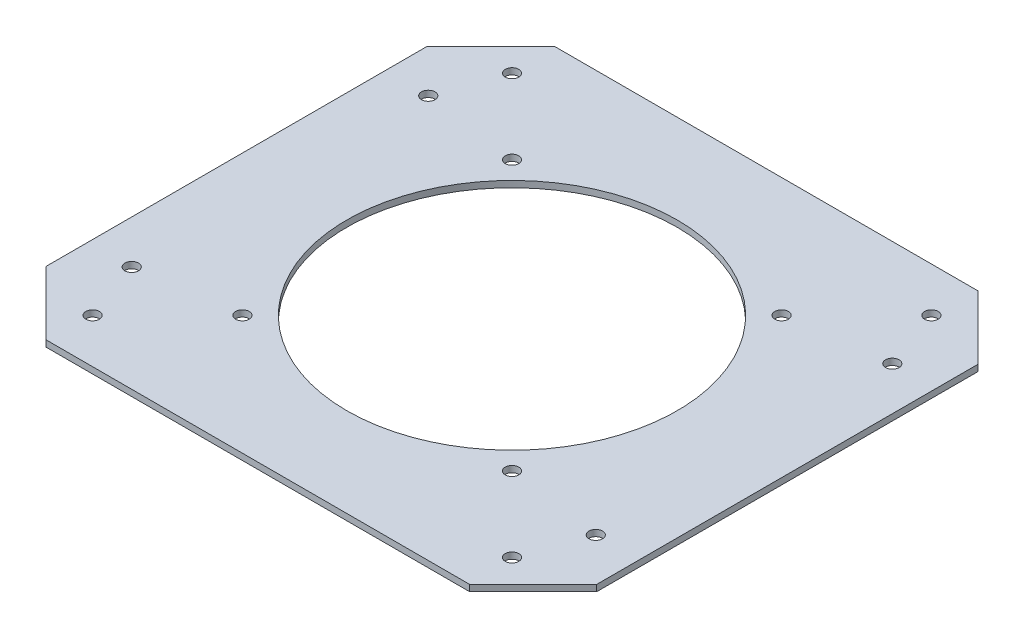
ISO-10303-21;
HEADER;
FILE_DESCRIPTION(('STEP AP214'),'2;1');
FILE_NAME('part.step','',(''),(''),'','','');
FILE_SCHEMA(('AUTOMOTIVE_DESIGN { 1 0 10303 214 1 1 1 1 }'));
ENDSEC;
DATA;
#1=APPLICATION_CONTEXT('core data for automotive mechanical design processes');
#2=APPLICATION_PROTOCOL_DEFINITION('international standard','automotive_design',2000,#1);
#3=PRODUCT_CONTEXT('',#1,'mechanical');
#4=PRODUCT('Part','Part','',(#3));
#5=PRODUCT_RELATED_PRODUCT_CATEGORY('part','',(#4));
#6=PRODUCT_DEFINITION_FORMATION('','',#4);
#7=PRODUCT_DEFINITION_CONTEXT('part definition',#1,'design');
#8=PRODUCT_DEFINITION('design','',#6,#7);
#9=PRODUCT_DEFINITION_SHAPE('','',#8);
#10=(LENGTH_UNIT() NAMED_UNIT(*) SI_UNIT(.MILLI.,.METRE.));
#11=(NAMED_UNIT(*) PLANE_ANGLE_UNIT() SI_UNIT($,.RADIAN.));
#12=(NAMED_UNIT(*) SI_UNIT($,.STERADIAN.) SOLID_ANGLE_UNIT());
#13=UNCERTAINTY_MEASURE_WITH_UNIT(LENGTH_MEASURE(1.E-05),#10,'distance_accuracy_value','');
#14=(GEOMETRIC_REPRESENTATION_CONTEXT(3) GLOBAL_UNCERTAINTY_ASSIGNED_CONTEXT((#13)) GLOBAL_UNIT_ASSIGNED_CONTEXT((#10,
#11,#12)) REPRESENTATION_CONTEXT('',''));
#15=CARTESIAN_POINT('',(0.,0.,0.));
#16=DIRECTION('',(0.,0.,1.));
#17=DIRECTION('',(1.,0.,0.));
#18=AXIS2_PLACEMENT_3D('',#15,#16,#17);
#19=CARTESIAN_POINT('',(-54.7722563,-43.7945736406198,-35.));
#20=DIRECTION('',(0.,1.,0.));
#21=DIRECTION('',(0.,0.,1.));
#22=AXIS2_PLACEMENT_3D('',#19,#20,#21);
#23=CYLINDRICAL_SURFACE('',#22,1.6);
#24=CARTESIAN_POINT('',(-54.7722563,5.5,-35.));
#25=DIRECTION('',(0.,1.,0.));
#26=DIRECTION('',(0.,0.,1.));
#27=AXIS2_PLACEMENT_3D('',#24,#25,#26);
#28=CIRCLE('',#27,1.6);
#29=CARTESIAN_POINT('',(-54.7722563,5.5,-33.4));
#30=VERTEX_POINT('',#29);
#31=EDGE_CURVE('E228',#30,#30,#28,.T.);
#32=ORIENTED_EDGE('',*,*,#31,.T.);
#33=EDGE_LOOP('',(#32));
#34=FACE_BOUND('',#33,.T.);
#35=CARTESIAN_POINT('',(-54.7722563,4.,-35.));
#36=DIRECTION('',(0.,-1.,0.));
#37=DIRECTION('',(0.,0.,-1.));
#38=AXIS2_PLACEMENT_3D('',#35,#36,#37);
#39=CIRCLE('',#38,1.6);
#40=CARTESIAN_POINT('',(-54.7722563,4.,-36.6));
#41=VERTEX_POINT('',#40);
#42=EDGE_CURVE('E225',#41,#41,#39,.F.);
#43=ORIENTED_EDGE('',*,*,#42,.F.);
#44=EDGE_LOOP('',(#43));
#45=FACE_BOUND('',#44,.T.);
#46=ADVANCED_FACE('F70',(#34,#45),#23,.F.);
#47=CARTESIAN_POINT('',(54.7722563,-43.7945736406198,-35.));
#48=DIRECTION('',(0.,1.,0.));
#49=DIRECTION('',(0.,0.,1.));
#50=AXIS2_PLACEMENT_3D('',#47,#48,#49);
#51=CYLINDRICAL_SURFACE('',#50,1.6);
#52=CARTESIAN_POINT('',(54.7722563,5.5,-35.));
#53=DIRECTION('',(0.,1.,0.));
#54=DIRECTION('',(0.,0.,1.));
#55=AXIS2_PLACEMENT_3D('',#52,#53,#54);
#56=CIRCLE('',#55,1.59999999999999);
#57=CARTESIAN_POINT('',(54.7722563,5.5,-33.4));
#58=VERTEX_POINT('',#57);
#59=EDGE_CURVE('E237',#58,#58,#56,.T.);
#60=ORIENTED_EDGE('',*,*,#59,.T.);
#61=EDGE_LOOP('',(#60));
#62=FACE_BOUND('',#61,.T.);
#63=CARTESIAN_POINT('',(54.7722563,4.,-35.));
#64=DIRECTION('',(0.,-1.,0.));
#65=DIRECTION('',(0.,0.,-1.));
#66=AXIS2_PLACEMENT_3D('',#63,#64,#65);
#67=CIRCLE('',#66,1.6);
#68=CARTESIAN_POINT('',(54.7722563,4.,-36.6));
#69=VERTEX_POINT('',#68);
#70=EDGE_CURVE('E222',#69,#69,#67,.F.);
#71=ORIENTED_EDGE('',*,*,#70,.F.);
#72=EDGE_LOOP('',(#71));
#73=FACE_BOUND('',#72,.T.);
#74=ADVANCED_FACE('F327',(#62,#73),#51,.F.);
#75=CARTESIAN_POINT('',(54.7722563,-43.7945736406198,35.));
#76=DIRECTION('',(0.,1.,0.));
#77=DIRECTION('',(0.,0.,1.));
#78=AXIS2_PLACEMENT_3D('',#75,#76,#77);
#79=CYLINDRICAL_SURFACE('',#78,1.6);
#80=CARTESIAN_POINT('',(54.7722563,5.5,35.));
#81=DIRECTION('',(0.,1.,0.));
#82=DIRECTION('',(0.,0.,1.));
#83=AXIS2_PLACEMENT_3D('',#80,#81,#82);
#84=CIRCLE('',#83,1.6);
#85=CARTESIAN_POINT('',(54.7722563,5.5,36.6));
#86=VERTEX_POINT('',#85);
#87=EDGE_CURVE('E234',#86,#86,#84,.T.);
#88=ORIENTED_EDGE('',*,*,#87,.T.);
#89=EDGE_LOOP('',(#88));
#90=FACE_BOUND('',#89,.T.);
#91=CARTESIAN_POINT('',(54.7722563,4.,35.));
#92=DIRECTION('',(0.,-1.,0.));
#93=DIRECTION('',(0.,0.,-1.));
#94=AXIS2_PLACEMENT_3D('',#91,#92,#93);
#95=CIRCLE('',#94,1.6);
#96=CARTESIAN_POINT('',(54.7722563,4.,33.4));
#97=VERTEX_POINT('',#96);
#98=EDGE_CURVE('E219',#97,#97,#95,.F.);
#99=ORIENTED_EDGE('',*,*,#98,.F.);
#100=EDGE_LOOP('',(#99));
#101=FACE_BOUND('',#100,.T.);
#102=ADVANCED_FACE('F332',(#90,#101),#79,.F.);
#103=CARTESIAN_POINT('',(-54.7722563,-43.7945736406198,35.));
#104=DIRECTION('',(0.,1.,0.));
#105=DIRECTION('',(0.,0.,1.));
#106=AXIS2_PLACEMENT_3D('',#103,#104,#105);
#107=CYLINDRICAL_SURFACE('',#106,1.6);
#108=CARTESIAN_POINT('',(-54.7722563,5.5,35.));
#109=DIRECTION('',(0.,1.,0.));
#110=DIRECTION('',(0.,0.,1.));
#111=AXIS2_PLACEMENT_3D('',#108,#109,#110);
#112=CIRCLE('',#111,1.6);
#113=CARTESIAN_POINT('',(-54.7722563,5.5,36.6));
#114=VERTEX_POINT('',#113);
#115=EDGE_CURVE('E231',#114,#114,#112,.T.);
#116=ORIENTED_EDGE('',*,*,#115,.T.);
#117=EDGE_LOOP('',(#116));
#118=FACE_BOUND('',#117,.T.);
#119=CARTESIAN_POINT('',(-54.7722563,4.,35.));
#120=DIRECTION('',(0.,-1.,0.));
#121=DIRECTION('',(0.,0.,-1.));
#122=AXIS2_PLACEMENT_3D('',#119,#120,#121);
#123=CIRCLE('',#122,1.6);
#124=CARTESIAN_POINT('',(-54.7722563,4.,33.4));
#125=VERTEX_POINT('',#124);
#126=EDGE_CURVE('E216',#125,#125,#123,.F.);
#127=ORIENTED_EDGE('',*,*,#126,.F.);
#128=EDGE_LOOP('',(#127));
#129=FACE_BOUND('',#128,.T.);
#130=ADVANCED_FACE('F340',(#118,#129),#107,.F.);
#131=CARTESIAN_POINT('',(0.,5.5,0.));
#132=DIRECTION('',(0.,-1.,0.));
#133=DIRECTION('',(0.,0.,-1.));
#134=AXIS2_PLACEMENT_3D('',#131,#132,#133);
#135=PLANE('',#134);
#136=CARTESIAN_POINT('',(49.4974746830588,5.5,-49.4974746830578));
#137=DIRECTION('',(0.,1.,0.));
#138=DIRECTION('',(0.,0.,1.));
#139=AXIS2_PLACEMENT_3D('',#136,#137,#138);
#140=CIRCLE('',#139,1.6);
#141=CARTESIAN_POINT('',(49.4974746830588,5.5,-47.8974746830578));
#142=VERTEX_POINT('',#141);
#143=EDGE_CURVE('E301',#142,#142,#140,.T.);
#144=ORIENTED_EDGE('',*,*,#143,.F.);
#145=EDGE_LOOP('',(#144));
#146=FACE_BOUND('',#145,.T.);
#147=CARTESIAN_POINT('',(-49.497474683058,5.5,-49.4974746830587));
#148=DIRECTION('',(0.,1.,0.));
#149=DIRECTION('',(0.,0.,1.));
#150=AXIS2_PLACEMENT_3D('',#147,#148,#149);
#151=CIRCLE('',#150,1.6);
#152=CARTESIAN_POINT('',(-49.497474683058,5.5,-47.8974746830587));
#153=VERTEX_POINT('',#152);
#154=EDGE_CURVE('E298',#153,#153,#151,.T.);
#155=ORIENTED_EDGE('',*,*,#154,.F.);
#156=EDGE_LOOP('',(#155));
#157=FACE_BOUND('',#156,.T.);
#158=CARTESIAN_POINT('',(-49.4974746830585,5.5,49.4974746830582));
#159=DIRECTION('',(0.,1.,0.));
#160=DIRECTION('',(0.,0.,1.));
#161=AXIS2_PLACEMENT_3D('',#158,#159,#160);
#162=CIRCLE('',#161,1.6);
#163=CARTESIAN_POINT('',(-49.4974746830585,5.5,51.0974746830581));
#164=VERTEX_POINT('',#163);
#165=EDGE_CURVE('E295',#164,#164,#162,.T.);
#166=ORIENTED_EDGE('',*,*,#165,.F.);
#167=EDGE_LOOP('',(#166));
#168=FACE_BOUND('',#167,.T.);
#169=CARTESIAN_POINT('',(49.4974746830583,5.5,49.4974746830583));
#170=DIRECTION('',(0.,1.,0.));
#171=DIRECTION('',(0.,0.,1.));
#172=AXIS2_PLACEMENT_3D('',#169,#170,#171);
#173=CIRCLE('',#172,1.6);
#174=CARTESIAN_POINT('',(49.4974746830583,5.5,51.0974746830583));
#175=VERTEX_POINT('',#174);
#176=EDGE_CURVE('E264',#175,#175,#173,.T.);
#177=ORIENTED_EDGE('',*,*,#176,.F.);
#178=EDGE_LOOP('',(#177));
#179=FACE_BOUND('',#178,.T.);
#180=DIRECTION('',(-1.,0.,0.));
#181=VECTOR('',#180,1.);
#182=CARTESIAN_POINT('',(50.,5.5,-60.));
#183=LINE('',#182,#181);
#184=CARTESIAN_POINT('',(50.,5.5,-60.));
#185=VERTEX_POINT('',#184);
#186=CARTESIAN_POINT('',(-50.,5.5,-60.));
#187=VERTEX_POINT('',#186);
#188=EDGE_CURVE('E188',#185,#187,#183,.T.);
#189=ORIENTED_EDGE('',*,*,#188,.T.);
#190=DIRECTION('',(-0.707106781186548,0.,0.707106781186548));
#191=VECTOR('',#190,1.);
#192=CARTESIAN_POINT('',(-65.,5.5,-45.));
#193=LINE('',#192,#191);
#194=CARTESIAN_POINT('',(-65.,5.5,-45.));
#195=VERTEX_POINT('',#194);
#196=EDGE_CURVE('E129',#187,#195,#193,.T.);
#197=ORIENTED_EDGE('',*,*,#196,.T.);
#198=DIRECTION('',(0.,0.,1.));
#199=VECTOR('',#198,1.);
#200=CARTESIAN_POINT('',(-65.,5.5,0.));
#201=LINE('',#200,#199);
#202=CARTESIAN_POINT('',(-65.,5.5,45.));
#203=VERTEX_POINT('',#202);
#204=EDGE_CURVE('E88',#195,#203,#201,.T.);
#205=ORIENTED_EDGE('',*,*,#204,.T.);
#206=DIRECTION('',(0.707106781186548,0.,0.707106781186548));
#207=VECTOR('',#206,1.);
#208=CARTESIAN_POINT('',(-65.,5.5,45.));
#209=LINE('',#208,#207);
#210=CARTESIAN_POINT('',(-49.9999999999999,5.5,60.));
#211=VERTEX_POINT('',#210);
#212=EDGE_CURVE('E242',#203,#211,#209,.T.);
#213=ORIENTED_EDGE('',*,*,#212,.T.);
#214=DIRECTION('',(1.,0.,0.));
#215=VECTOR('',#214,1.);
#216=CARTESIAN_POINT('',(50.,5.5,60.));
#217=LINE('',#216,#215);
#218=CARTESIAN_POINT('',(50.,5.5,60.));
#219=VERTEX_POINT('',#218);
#220=EDGE_CURVE('E179',#211,#219,#217,.T.);
#221=ORIENTED_EDGE('',*,*,#220,.T.);
#222=DIRECTION('',(0.707106781186549,0.,-0.707106781186546));
#223=VECTOR('',#222,1.);
#224=CARTESIAN_POINT('',(65.,5.5,45.));
#225=LINE('',#224,#223);
#226=CARTESIAN_POINT('',(65.,5.5,45.));
#227=VERTEX_POINT('',#226);
#228=EDGE_CURVE('E182',#219,#227,#225,.T.);
#229=ORIENTED_EDGE('',*,*,#228,.T.);
#230=DIRECTION('',(0.,0.,-1.));
#231=VECTOR('',#230,1.);
#232=CARTESIAN_POINT('',(65.,5.5,45.));
#233=LINE('',#232,#231);
#234=CARTESIAN_POINT('',(65.,5.5,-45.));
#235=VERTEX_POINT('',#234);
#236=EDGE_CURVE('E185',#227,#235,#233,.T.);
#237=ORIENTED_EDGE('',*,*,#236,.T.);
#238=DIRECTION('',(-0.707106781186549,0.,-0.707106781186546));
#239=VECTOR('',#238,1.);
#240=CARTESIAN_POINT('',(65.,5.5,-45.));
#241=LINE('',#240,#239);
#242=EDGE_CURVE('E153',#235,#185,#241,.T.);
#243=ORIENTED_EDGE('',*,*,#242,.T.);
#244=EDGE_LOOP('',(#189,#197,#205,#213,#221,#229,#237,#243));
#245=FACE_BOUND('',#244,.T.);
#246=CARTESIAN_POINT('',(-31.819805153395,5.5,-31.8198051533947));
#247=DIRECTION('',(0.,1.,0.));
#248=DIRECTION('',(0.,0.,1.));
#249=AXIS2_PLACEMENT_3D('',#246,#247,#248);
#250=CIRCLE('',#249,1.6);
#251=CARTESIAN_POINT('',(-31.819805153395,5.5,-30.2198051533947));
#252=VERTEX_POINT('',#251);
#253=EDGE_CURVE('E202',#252,#252,#250,.T.);
#254=ORIENTED_EDGE('',*,*,#253,.F.);
#255=EDGE_LOOP('',(#254));
#256=FACE_BOUND('',#255,.T.);
#257=CARTESIAN_POINT('',(31.8198051533946,5.5,31.8198051533942));
#258=DIRECTION('',(0.,1.,0.));
#259=DIRECTION('',(0.,0.,1.));
#260=AXIS2_PLACEMENT_3D('',#257,#258,#259);
#261=CIRCLE('',#260,1.6);
#262=CARTESIAN_POINT('',(31.8198051533946,5.5,33.4198051533942));
#263=VERTEX_POINT('',#262);
#264=EDGE_CURVE('E201',#263,#263,#261,.T.);
#265=ORIENTED_EDGE('',*,*,#264,.F.);
#266=EDGE_LOOP('',(#265));
#267=FACE_BOUND('',#266,.T.);
#268=CARTESIAN_POINT('',(-31.819805153395,5.5,31.8198051533956));
#269=DIRECTION('',(0.,1.,0.));
#270=DIRECTION('',(0.,0.,1.));
#271=AXIS2_PLACEMENT_3D('',#268,#269,#270);
#272=CIRCLE('',#271,1.6);
#273=CARTESIAN_POINT('',(-31.819805153395,5.5,33.4198051533956));
#274=VERTEX_POINT('',#273);
#275=EDGE_CURVE('E193',#274,#274,#272,.T.);
#276=ORIENTED_EDGE('',*,*,#275,.F.);
#277=EDGE_LOOP('',(#276));
#278=FACE_BOUND('',#277,.T.);
#279=CARTESIAN_POINT('',(31.8198051533946,5.5,-31.8198051533947));
#280=DIRECTION('',(0.,1.,0.));
#281=DIRECTION('',(0.,0.,1.));
#282=AXIS2_PLACEMENT_3D('',#279,#280,#281);
#283=CIRCLE('',#282,1.6);
#284=CARTESIAN_POINT('',(31.8198051533946,5.5,-30.2198051533947));
#285=VERTEX_POINT('',#284);
#286=EDGE_CURVE('E205',#285,#285,#283,.T.);
#287=ORIENTED_EDGE('',*,*,#286,.F.);
#288=EDGE_LOOP('',(#287));
#289=FACE_BOUND('',#288,.T.);
#290=CARTESIAN_POINT('',(0.,5.5,0.));
#291=DIRECTION('',(0.,1.,0.));
#292=DIRECTION('',(0.,0.,1.));
#293=AXIS2_PLACEMENT_3D('',#290,#291,#292);
#294=CIRCLE('',#293,39.);
#295=CARTESIAN_POINT('',(0.,5.5,39.));
#296=VERTEX_POINT('',#295);
#297=EDGE_CURVE('E211',#296,#296,#294,.T.);
#298=ORIENTED_EDGE('',*,*,#297,.F.);
#299=EDGE_LOOP('',(#298));
#300=FACE_BOUND('',#299,.T.);
#301=ORIENTED_EDGE('',*,*,#59,.F.);
#302=EDGE_LOOP('',(#301));
#303=FACE_BOUND('',#302,.T.);
#304=ORIENTED_EDGE('',*,*,#87,.F.);
#305=EDGE_LOOP('',(#304));
#306=FACE_BOUND('',#305,.T.);
#307=ORIENTED_EDGE('',*,*,#115,.F.);
#308=EDGE_LOOP('',(#307));
#309=FACE_BOUND('',#308,.T.);
#310=ORIENTED_EDGE('',*,*,#31,.F.);
#311=EDGE_LOOP('',(#310));
#312=FACE_BOUND('',#311,.T.);
#313=ADVANCED_FACE('F279',(#146,#157,#168,#179,#245,#256,#267,#278,#289,#300,#303,#306,#309,
#312),#135,.F.);
#314=CARTESIAN_POINT('',(0.,4.,0.));
#315=DIRECTION('',(0.,-1.,0.));
#316=DIRECTION('',(0.,0.,-1.));
#317=AXIS2_PLACEMENT_3D('',#314,#315,#316);
#318=PLANE('',#317);
#319=CARTESIAN_POINT('',(49.4974746830588,4.,-49.4974746830578));
#320=DIRECTION('',(0.,-1.,0.));
#321=DIRECTION('',(0.,0.,-1.));
#322=AXIS2_PLACEMENT_3D('',#319,#320,#321);
#323=CIRCLE('',#322,1.6);
#324=CARTESIAN_POINT('',(49.4974746830588,4.,-51.0974746830578));
#325=VERTEX_POINT('',#324);
#326=EDGE_CURVE('E73',#325,#325,#323,.T.);
#327=ORIENTED_EDGE('',*,*,#326,.F.);
#328=EDGE_LOOP('',(#327));
#329=FACE_BOUND('',#328,.T.);
#330=CARTESIAN_POINT('',(-49.497474683058,4.,-49.4974746830587));
#331=DIRECTION('',(0.,-1.,0.));
#332=DIRECTION('',(0.,0.,-1.));
#333=AXIS2_PLACEMENT_3D('',#330,#331,#332);
#334=CIRCLE('',#333,1.6);
#335=CARTESIAN_POINT('',(-49.497474683058,4.,-51.0974746830587));
#336=VERTEX_POINT('',#335);
#337=EDGE_CURVE('E266',#336,#336,#334,.T.);
#338=ORIENTED_EDGE('',*,*,#337,.F.);
#339=EDGE_LOOP('',(#338));
#340=FACE_BOUND('',#339,.T.);
#341=CARTESIAN_POINT('',(-49.4974746830585,4.,49.4974746830582));
#342=DIRECTION('',(0.,-1.,0.));
#343=DIRECTION('',(0.,0.,-1.));
#344=AXIS2_PLACEMENT_3D('',#341,#342,#343);
#345=CIRCLE('',#344,1.6);
#346=CARTESIAN_POINT('',(-49.4974746830585,4.,47.8974746830582));
#347=VERTEX_POINT('',#346);
#348=EDGE_CURVE('E263',#347,#347,#345,.T.);
#349=ORIENTED_EDGE('',*,*,#348,.F.);
#350=EDGE_LOOP('',(#349));
#351=FACE_BOUND('',#350,.T.);
#352=CARTESIAN_POINT('',(49.4974746830583,4.,49.4974746830583));
#353=DIRECTION('',(0.,-1.,0.));
#354=DIRECTION('',(0.,0.,-1.));
#355=AXIS2_PLACEMENT_3D('',#352,#353,#354);
#356=CIRCLE('',#355,1.6);
#357=CARTESIAN_POINT('',(49.4974746830583,4.,47.8974746830583));
#358=VERTEX_POINT('',#357);
#359=EDGE_CURVE('E260',#358,#358,#356,.T.);
#360=ORIENTED_EDGE('',*,*,#359,.F.);
#361=EDGE_LOOP('',(#360));
#362=FACE_BOUND('',#361,.T.);
#363=DIRECTION('',(-0.707106781186548,0.,0.707106781186548));
#364=VECTOR('',#363,1.);
#365=CARTESIAN_POINT('',(-65.,4.,-45.));
#366=LINE('',#365,#364);
#367=CARTESIAN_POINT('',(-50.,4.,-60.));
#368=VERTEX_POINT('',#367);
#369=CARTESIAN_POINT('',(-65.,4.,-45.));
#370=VERTEX_POINT('',#369);
#371=EDGE_CURVE('E104',#368,#370,#366,.T.);
#372=ORIENTED_EDGE('',*,*,#371,.F.);
#373=DIRECTION('',(-1.,0.,0.));
#374=VECTOR('',#373,1.);
#375=CARTESIAN_POINT('',(50.,4.,-60.));
#376=LINE('',#375,#374);
#377=CARTESIAN_POINT('',(50.,4.,-60.));
#378=VERTEX_POINT('',#377);
#379=EDGE_CURVE('E168',#378,#368,#376,.T.);
#380=ORIENTED_EDGE('',*,*,#379,.F.);
#381=DIRECTION('',(-0.707106781186549,0.,-0.707106781186546));
#382=VECTOR('',#381,1.);
#383=CARTESIAN_POINT('',(65.,4.,-45.));
#384=LINE('',#383,#382);
#385=CARTESIAN_POINT('',(65.,4.,-45.));
#386=VERTEX_POINT('',#385);
#387=EDGE_CURVE('E151',#386,#378,#384,.T.);
#388=ORIENTED_EDGE('',*,*,#387,.F.);
#389=DIRECTION('',(0.,0.,-1.));
#390=VECTOR('',#389,1.);
#391=CARTESIAN_POINT('',(65.,4.,45.));
#392=LINE('',#391,#390);
#393=CARTESIAN_POINT('',(65.,4.,45.));
#394=VERTEX_POINT('',#393);
#395=EDGE_CURVE('E165',#394,#386,#392,.T.);
#396=ORIENTED_EDGE('',*,*,#395,.F.);
#397=DIRECTION('',(0.707106781186549,0.,-0.707106781186546));
#398=VECTOR('',#397,1.);
#399=CARTESIAN_POINT('',(65.,4.,45.));
#400=LINE('',#399,#398);
#401=CARTESIAN_POINT('',(50.,4.,60.));
#402=VERTEX_POINT('',#401);
#403=EDGE_CURVE('E171',#402,#394,#400,.T.);
#404=ORIENTED_EDGE('',*,*,#403,.F.);
#405=DIRECTION('',(1.,0.,0.));
#406=VECTOR('',#405,1.);
#407=CARTESIAN_POINT('',(50.,4.,60.));
#408=LINE('',#407,#406);
#409=CARTESIAN_POINT('',(-49.9999999999999,4.,60.));
#410=VERTEX_POINT('',#409);
#411=EDGE_CURVE('E173',#410,#402,#408,.T.);
#412=ORIENTED_EDGE('',*,*,#411,.F.);
#413=DIRECTION('',(0.707106781186548,0.,0.707106781186548));
#414=VECTOR('',#413,1.);
#415=CARTESIAN_POINT('',(-65.,4.,45.));
#416=LINE('',#415,#414);
#417=CARTESIAN_POINT('',(-65.,4.,45.));
#418=VERTEX_POINT('',#417);
#419=EDGE_CURVE('E137',#418,#410,#416,.T.);
#420=ORIENTED_EDGE('',*,*,#419,.F.);
#421=DIRECTION('',(0.,0.,1.));
#422=VECTOR('',#421,1.);
#423=CARTESIAN_POINT('',(-65.,4.,0.));
#424=LINE('',#423,#422);
#425=EDGE_CURVE('E99',#370,#418,#424,.T.);
#426=ORIENTED_EDGE('',*,*,#425,.F.);
#427=EDGE_LOOP('',(#372,#380,#388,#396,#404,#412,#420,#426));
#428=FACE_BOUND('',#427,.T.);
#429=CARTESIAN_POINT('',(-31.819805153395,4.,-31.8198051533947));
#430=DIRECTION('',(0.,-1.,0.));
#431=DIRECTION('',(0.,0.,-1.));
#432=AXIS2_PLACEMENT_3D('',#429,#430,#431);
#433=CIRCLE('',#432,1.6);
#434=CARTESIAN_POINT('',(-31.819805153395,4.,-33.4198051533947));
#435=VERTEX_POINT('',#434);
#436=EDGE_CURVE('E215',#435,#435,#433,.T.);
#437=ORIENTED_EDGE('',*,*,#436,.F.);
#438=EDGE_LOOP('',(#437));
#439=FACE_BOUND('',#438,.T.);
#440=CARTESIAN_POINT('',(31.8198051533946,4.,31.8198051533942));
#441=DIRECTION('',(0.,-1.,0.));
#442=DIRECTION('',(0.,0.,-1.));
#443=AXIS2_PLACEMENT_3D('',#440,#441,#442);
#444=CIRCLE('',#443,1.6);
#445=CARTESIAN_POINT('',(31.8198051533946,4.,30.2198051533943));
#446=VERTEX_POINT('',#445);
#447=EDGE_CURVE('E255',#446,#446,#444,.T.);
#448=ORIENTED_EDGE('',*,*,#447,.F.);
#449=EDGE_LOOP('',(#448));
#450=FACE_BOUND('',#449,.T.);
#451=CARTESIAN_POINT('',(-31.819805153395,4.,31.8198051533956));
#452=DIRECTION('',(0.,-1.,0.));
#453=DIRECTION('',(0.,0.,-1.));
#454=AXIS2_PLACEMENT_3D('',#451,#452,#453);
#455=CIRCLE('',#454,1.6);
#456=CARTESIAN_POINT('',(-31.819805153395,4.,30.2198051533956));
#457=VERTEX_POINT('',#456);
#458=EDGE_CURVE('E252',#457,#457,#455,.T.);
#459=ORIENTED_EDGE('',*,*,#458,.F.);
#460=EDGE_LOOP('',(#459));
#461=FACE_BOUND('',#460,.T.);
#462=CARTESIAN_POINT('',(31.8198051533946,4.,-31.8198051533947));
#463=DIRECTION('',(0.,-1.,0.));
#464=DIRECTION('',(0.,0.,-1.));
#465=AXIS2_PLACEMENT_3D('',#462,#463,#464);
#466=CIRCLE('',#465,1.6);
#467=CARTESIAN_POINT('',(31.8198051533946,4.,-33.4198051533947));
#468=VERTEX_POINT('',#467);
#469=EDGE_CURVE('E210',#468,#468,#466,.T.);
#470=ORIENTED_EDGE('',*,*,#469,.F.);
#471=EDGE_LOOP('',(#470));
#472=FACE_BOUND('',#471,.T.);
#473=CARTESIAN_POINT('',(0.,4.,0.));
#474=DIRECTION('',(0.,-1.,0.));
#475=DIRECTION('',(0.,0.,-1.));
#476=AXIS2_PLACEMENT_3D('',#473,#474,#475);
#477=CIRCLE('',#476,39.);
#478=CARTESIAN_POINT('',(0.,4.,-39.));
#479=VERTEX_POINT('',#478);
#480=EDGE_CURVE('E214',#479,#479,#477,.T.);
#481=ORIENTED_EDGE('',*,*,#480,.F.);
#482=EDGE_LOOP('',(#481));
#483=FACE_BOUND('',#482,.T.);
#484=ORIENTED_EDGE('',*,*,#126,.T.);
#485=EDGE_LOOP('',(#484));
#486=FACE_BOUND('',#485,.T.);
#487=ORIENTED_EDGE('',*,*,#98,.T.);
#488=EDGE_LOOP('',(#487));
#489=FACE_BOUND('',#488,.T.);
#490=ORIENTED_EDGE('',*,*,#70,.T.);
#491=EDGE_LOOP('',(#490));
#492=FACE_BOUND('',#491,.T.);
#493=ORIENTED_EDGE('',*,*,#42,.T.);
#494=EDGE_LOOP('',(#493));
#495=FACE_BOUND('',#494,.T.);
#496=ADVANCED_FACE('F162',(#329,#340,#351,#362,#428,#439,#450,#461,#472,#483,#486,#489,#492,
#495),#318,.T.);
#497=CARTESIAN_POINT('',(-65.,5.5,-45.));
#498=DIRECTION('',(0.707106781186547,0.,0.707106781186547));
#499=DIRECTION('',(0.707106781186548,0.,-0.707106781186548));
#500=AXIS2_PLACEMENT_3D('',#497,#498,#499);
#501=PLANE('',#500);
#502=ORIENTED_EDGE('',*,*,#371,.T.);
#503=DIRECTION('',(0.,-1.,0.));
#504=VECTOR('',#503,1.);
#505=CARTESIAN_POINT('',(-65.,5.5,-45.));
#506=LINE('',#505,#504);
#507=EDGE_CURVE('E12',#195,#370,#506,.T.);
#508=ORIENTED_EDGE('',*,*,#507,.F.);
#509=ORIENTED_EDGE('',*,*,#196,.F.);
#510=DIRECTION('',(0.,1.,0.));
#511=VECTOR('',#510,1.);
#512=CARTESIAN_POINT('',(-50.,4.,-60.));
#513=LINE('',#512,#511);
#514=EDGE_CURVE('E191',#368,#187,#513,.T.);
#515=ORIENTED_EDGE('',*,*,#514,.F.);
#516=EDGE_LOOP('',(#502,#508,#509,#515));
#517=FACE_BOUND('',#516,.T.);
#518=ADVANCED_FACE('F278',(#517),#501,.F.);
#519=CARTESIAN_POINT('',(-65.,5.5,0.));
#520=DIRECTION('',(1.,0.,0.));
#521=DIRECTION('',(0.,0.,-1.));
#522=AXIS2_PLACEMENT_3D('',#519,#520,#521);
#523=PLANE('',#522);
#524=ORIENTED_EDGE('',*,*,#425,.T.);
#525=DIRECTION('',(0.,-1.,0.));
#526=VECTOR('',#525,1.);
#527=CARTESIAN_POINT('',(-65.,5.5,45.));
#528=LINE('',#527,#526);
#529=EDGE_CURVE('E79',#203,#418,#528,.T.);
#530=ORIENTED_EDGE('',*,*,#529,.F.);
#531=ORIENTED_EDGE('',*,*,#204,.F.);
#532=ORIENTED_EDGE('',*,*,#507,.T.);
#533=EDGE_LOOP('',(#524,#530,#531,#532));
#534=FACE_BOUND('',#533,.T.);
#535=ADVANCED_FACE('F315',(#534),#523,.F.);
#536=CARTESIAN_POINT('',(-65.,5.5,45.));
#537=DIRECTION('',(0.707106781186547,0.,-0.707106781186547));
#538=DIRECTION('',(-0.707106781186548,0.,-0.707106781186548));
#539=AXIS2_PLACEMENT_3D('',#536,#537,#538);
#540=PLANE('',#539);
#541=ORIENTED_EDGE('',*,*,#419,.T.);
#542=DIRECTION('',(0.,1.,0.));
#543=VECTOR('',#542,1.);
#544=CARTESIAN_POINT('',(-49.9999999999999,4.,60.));
#545=LINE('',#544,#543);
#546=EDGE_CURVE('E178',#410,#211,#545,.T.);
#547=ORIENTED_EDGE('',*,*,#546,.T.);
#548=ORIENTED_EDGE('',*,*,#212,.F.);
#549=ORIENTED_EDGE('',*,*,#529,.T.);
#550=EDGE_LOOP('',(#541,#547,#548,#549));
#551=FACE_BOUND('',#550,.T.);
#552=ADVANCED_FACE('F312',(#551),#540,.F.);
#553=CARTESIAN_POINT('',(0.,-22.,0.));
#554=DIRECTION('',(0.,1.,0.));
#555=DIRECTION('',(0.,0.,1.));
#556=AXIS2_PLACEMENT_3D('',#553,#554,#555);
#557=CYLINDRICAL_SURFACE('',#556,39.);
#558=ORIENTED_EDGE('',*,*,#480,.T.);
#559=EDGE_LOOP('',(#558));
#560=FACE_BOUND('',#559,.T.);
#561=ORIENTED_EDGE('',*,*,#297,.T.);
#562=EDGE_LOOP('',(#561));
#563=FACE_BOUND('',#562,.T.);
#564=ADVANCED_FACE('F314',(#560,#563),#557,.F.);
#565=CARTESIAN_POINT('',(31.8198051533946,-22.,-31.8198051533947));
#566=DIRECTION('',(0.,1.,0.));
#567=DIRECTION('',(0.,0.,1.));
#568=AXIS2_PLACEMENT_3D('',#565,#566,#567);
#569=CYLINDRICAL_SURFACE('',#568,1.6);
#570=ORIENTED_EDGE('',*,*,#469,.T.);
#571=EDGE_LOOP('',(#570));
#572=FACE_BOUND('',#571,.T.);
#573=ORIENTED_EDGE('',*,*,#286,.T.);
#574=EDGE_LOOP('',(#573));
#575=FACE_BOUND('',#574,.T.);
#576=ADVANCED_FACE('F321',(#572,#575),#569,.F.);
#577=CARTESIAN_POINT('',(-31.819805153395,-22.,31.8198051533956));
#578=DIRECTION('',(0.,1.,0.));
#579=DIRECTION('',(0.,0.,1.));
#580=AXIS2_PLACEMENT_3D('',#577,#578,#579);
#581=CYLINDRICAL_SURFACE('',#580,1.6);
#582=ORIENTED_EDGE('',*,*,#458,.T.);
#583=EDGE_LOOP('',(#582));
#584=FACE_BOUND('',#583,.T.);
#585=ORIENTED_EDGE('',*,*,#275,.T.);
#586=EDGE_LOOP('',(#585));
#587=FACE_BOUND('',#586,.T.);
#588=ADVANCED_FACE('F353',(#584,#587),#581,.F.);
#589=CARTESIAN_POINT('',(31.8198051533946,-22.,31.8198051533942));
#590=DIRECTION('',(0.,1.,0.));
#591=DIRECTION('',(0.,0.,1.));
#592=AXIS2_PLACEMENT_3D('',#589,#590,#591);
#593=CYLINDRICAL_SURFACE('',#592,1.6);
#594=ORIENTED_EDGE('',*,*,#447,.T.);
#595=EDGE_LOOP('',(#594));
#596=FACE_BOUND('',#595,.T.);
#597=ORIENTED_EDGE('',*,*,#264,.T.);
#598=EDGE_LOOP('',(#597));
#599=FACE_BOUND('',#598,.T.);
#600=ADVANCED_FACE('F355',(#596,#599),#593,.F.);
#601=CARTESIAN_POINT('',(-31.819805153395,-22.,-31.8198051533947));
#602=DIRECTION('',(0.,1.,0.));
#603=DIRECTION('',(0.,0.,1.));
#604=AXIS2_PLACEMENT_3D('',#601,#602,#603);
#605=CYLINDRICAL_SURFACE('',#604,1.6);
#606=ORIENTED_EDGE('',*,*,#436,.T.);
#607=EDGE_LOOP('',(#606));
#608=FACE_BOUND('',#607,.T.);
#609=ORIENTED_EDGE('',*,*,#253,.T.);
#610=EDGE_LOOP('',(#609));
#611=FACE_BOUND('',#610,.T.);
#612=ADVANCED_FACE('F358',(#608,#611),#605,.F.);
#613=CARTESIAN_POINT('',(50.,4.,-60.));
#614=DIRECTION('',(0.,0.,-1.));
#615=DIRECTION('',(-1.,0.,0.));
#616=AXIS2_PLACEMENT_3D('',#613,#614,#615);
#617=PLANE('',#616);
#618=ORIENTED_EDGE('',*,*,#188,.F.);
#619=DIRECTION('',(0.,1.,0.));
#620=VECTOR('',#619,1.);
#621=CARTESIAN_POINT('',(50.,4.,-60.));
#622=LINE('',#621,#620);
#623=EDGE_CURVE('E158',#378,#185,#622,.T.);
#624=ORIENTED_EDGE('',*,*,#623,.F.);
#625=ORIENTED_EDGE('',*,*,#379,.T.);
#626=ORIENTED_EDGE('',*,*,#514,.T.);
#627=EDGE_LOOP('',(#618,#624,#625,#626));
#628=FACE_BOUND('',#627,.T.);
#629=ADVANCED_FACE('F362',(#628),#617,.T.);
#630=CARTESIAN_POINT('',(65.,4.,-45.));
#631=DIRECTION('',(0.707106781186546,0.,-0.707106781186549));
#632=DIRECTION('',(-0.707106781186549,0.,-0.707106781186546));
#633=AXIS2_PLACEMENT_3D('',#630,#631,#632);
#634=PLANE('',#633);
#635=ORIENTED_EDGE('',*,*,#242,.F.);
#636=DIRECTION('',(0.,1.,0.));
#637=VECTOR('',#636,1.);
#638=CARTESIAN_POINT('',(65.,4.,-45.));
#639=LINE('',#638,#637);
#640=EDGE_CURVE('E148',#386,#235,#639,.T.);
#641=ORIENTED_EDGE('',*,*,#640,.F.);
#642=ORIENTED_EDGE('',*,*,#387,.T.);
#643=ORIENTED_EDGE('',*,*,#623,.T.);
#644=EDGE_LOOP('',(#635,#641,#642,#643));
#645=FACE_BOUND('',#644,.T.);
#646=ADVANCED_FACE('F150',(#645),#634,.T.);
#647=CARTESIAN_POINT('',(65.,4.,45.));
#648=DIRECTION('',(1.,0.,0.));
#649=DIRECTION('',(0.,0.,-1.));
#650=AXIS2_PLACEMENT_3D('',#647,#648,#649);
#651=PLANE('',#650);
#652=ORIENTED_EDGE('',*,*,#236,.F.);
#653=DIRECTION('',(0.,1.,0.));
#654=VECTOR('',#653,1.);
#655=CARTESIAN_POINT('',(65.,4.,45.));
#656=LINE('',#655,#654);
#657=EDGE_CURVE('E159',#394,#227,#656,.T.);
#658=ORIENTED_EDGE('',*,*,#657,.F.);
#659=ORIENTED_EDGE('',*,*,#395,.T.);
#660=ORIENTED_EDGE('',*,*,#640,.T.);
#661=EDGE_LOOP('',(#652,#658,#659,#660));
#662=FACE_BOUND('',#661,.T.);
#663=ADVANCED_FACE('F170',(#662),#651,.T.);
#664=CARTESIAN_POINT('',(65.,4.,45.));
#665=DIRECTION('',(0.707106781186546,0.,0.707106781186549));
#666=DIRECTION('',(0.707106781186549,0.,-0.707106781186546));
#667=AXIS2_PLACEMENT_3D('',#664,#665,#666);
#668=PLANE('',#667);
#669=ORIENTED_EDGE('',*,*,#228,.F.);
#670=DIRECTION('',(0.,1.,0.));
#671=VECTOR('',#670,1.);
#672=CARTESIAN_POINT('',(50.,4.,60.));
#673=LINE('',#672,#671);
#674=EDGE_CURVE('E196',#402,#219,#673,.T.);
#675=ORIENTED_EDGE('',*,*,#674,.F.);
#676=ORIENTED_EDGE('',*,*,#403,.T.);
#677=ORIENTED_EDGE('',*,*,#657,.T.);
#678=EDGE_LOOP('',(#669,#675,#676,#677));
#679=FACE_BOUND('',#678,.T.);
#680=ADVANCED_FACE('F309',(#679),#668,.T.);
#681=CARTESIAN_POINT('',(50.,4.,60.));
#682=DIRECTION('',(0.,0.,1.));
#683=DIRECTION('',(1.,0.,0.));
#684=AXIS2_PLACEMENT_3D('',#681,#682,#683);
#685=PLANE('',#684);
#686=ORIENTED_EDGE('',*,*,#220,.F.);
#687=ORIENTED_EDGE('',*,*,#546,.F.);
#688=ORIENTED_EDGE('',*,*,#411,.T.);
#689=ORIENTED_EDGE('',*,*,#674,.T.);
#690=EDGE_LOOP('',(#686,#687,#688,#689));
#691=FACE_BOUND('',#690,.T.);
#692=ADVANCED_FACE('F290',(#691),#685,.T.);
#693=CARTESIAN_POINT('',(49.4974746830583,-4.5,49.4974746830583));
#694=DIRECTION('',(0.,1.,0.));
#695=DIRECTION('',(0.,0.,1.));
#696=AXIS2_PLACEMENT_3D('',#693,#694,#695);
#697=CYLINDRICAL_SURFACE('',#696,1.6);
#698=ORIENTED_EDGE('',*,*,#359,.T.);
#699=EDGE_LOOP('',(#698));
#700=FACE_BOUND('',#699,.T.);
#701=ORIENTED_EDGE('',*,*,#176,.T.);
#702=EDGE_LOOP('',(#701));
#703=FACE_BOUND('',#702,.T.);
#704=ADVANCED_FACE('F286',(#700,#703),#697,.F.);
#705=CARTESIAN_POINT('',(-49.4974746830585,-4.5,49.4974746830582));
#706=DIRECTION('',(0.,1.,0.));
#707=DIRECTION('',(0.,0.,1.));
#708=AXIS2_PLACEMENT_3D('',#705,#706,#707);
#709=CYLINDRICAL_SURFACE('',#708,1.6);
#710=ORIENTED_EDGE('',*,*,#348,.T.);
#711=EDGE_LOOP('',(#710));
#712=FACE_BOUND('',#711,.T.);
#713=ORIENTED_EDGE('',*,*,#165,.T.);
#714=EDGE_LOOP('',(#713));
#715=FACE_BOUND('',#714,.T.);
#716=ADVANCED_FACE('F289',(#712,#715),#709,.F.);
#717=CARTESIAN_POINT('',(-49.497474683058,-4.5,-49.4974746830587));
#718=DIRECTION('',(0.,1.,0.));
#719=DIRECTION('',(0.,0.,1.));
#720=AXIS2_PLACEMENT_3D('',#717,#718,#719);
#721=CYLINDRICAL_SURFACE('',#720,1.6);
#722=ORIENTED_EDGE('',*,*,#337,.T.);
#723=EDGE_LOOP('',(#722));
#724=FACE_BOUND('',#723,.T.);
#725=ORIENTED_EDGE('',*,*,#154,.T.);
#726=EDGE_LOOP('',(#725));
#727=FACE_BOUND('',#726,.T.);
#728=ADVANCED_FACE('F380',(#724,#727),#721,.F.);
#729=CARTESIAN_POINT('',(49.4974746830588,-4.5,-49.4974746830578));
#730=DIRECTION('',(0.,1.,0.));
#731=DIRECTION('',(0.,0.,1.));
#732=AXIS2_PLACEMENT_3D('',#729,#730,#731);
#733=CYLINDRICAL_SURFACE('',#732,1.6);
#734=ORIENTED_EDGE('',*,*,#326,.T.);
#735=EDGE_LOOP('',(#734));
#736=FACE_BOUND('',#735,.T.);
#737=ORIENTED_EDGE('',*,*,#143,.T.);
#738=EDGE_LOOP('',(#737));
#739=FACE_BOUND('',#738,.T.);
#740=ADVANCED_FACE('F273',(#736,#739),#733,.F.);
#741=CLOSED_SHELL('',(#46,#74,#102,#130,#313,#496,#518,#535,#552,#564,#576,#588,#600,#612,#629,
#646,#663,#680,#692,#704,#716,#728,#740));
#742=MANIFOLD_SOLID_BREP('B2',#741);
#743=ADVANCED_BREP_SHAPE_REPRESENTATION('',(#18,#742),#14);
#744=SHAPE_DEFINITION_REPRESENTATION(#9,#743);
ENDSEC;
END-ISO-10303-21;
